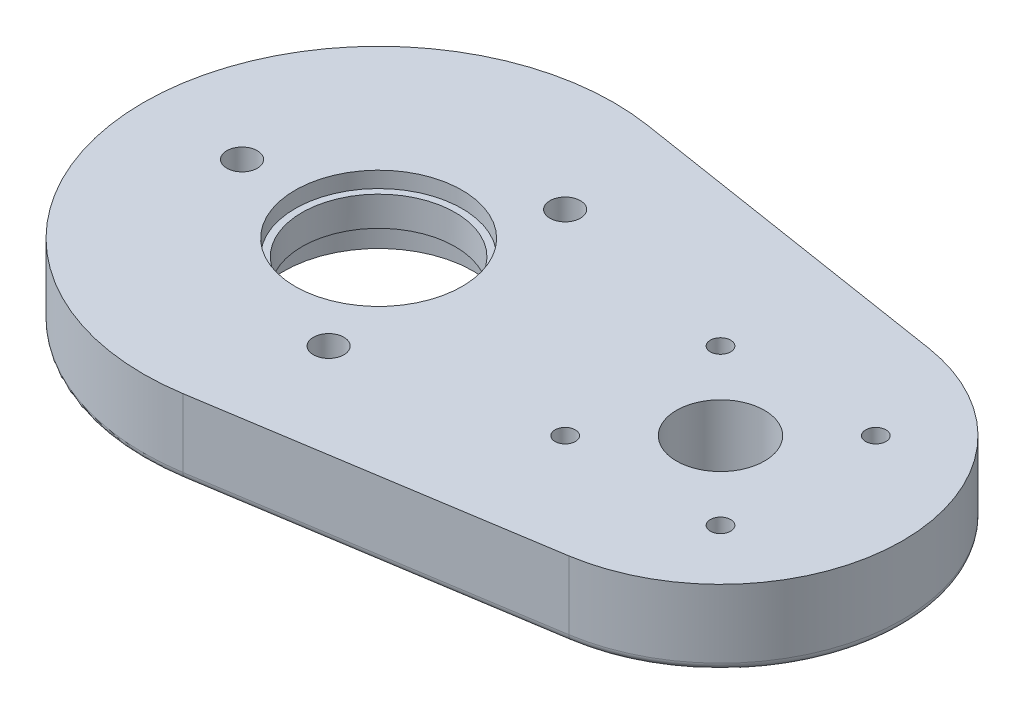
ISO-10303-21;
HEADER;
FILE_DESCRIPTION(('STEP AP214'),'2;1');
FILE_NAME('part.step','',(''),(''),'','','');
FILE_SCHEMA(('AUTOMOTIVE_DESIGN { 1 0 10303 214 1 1 1 1 }'));
ENDSEC;
DATA;
#1=APPLICATION_CONTEXT('core data for automotive mechanical design processes');
#2=APPLICATION_PROTOCOL_DEFINITION('international standard','automotive_design',2000,#1);
#3=PRODUCT_CONTEXT('',#1,'mechanical');
#4=PRODUCT('Part','Part','',(#3));
#5=PRODUCT_RELATED_PRODUCT_CATEGORY('part','',(#4));
#6=PRODUCT_DEFINITION_FORMATION('','',#4);
#7=PRODUCT_DEFINITION_CONTEXT('part definition',#1,'design');
#8=PRODUCT_DEFINITION('design','',#6,#7);
#9=PRODUCT_DEFINITION_SHAPE('','',#8);
#10=(LENGTH_UNIT() NAMED_UNIT(*) SI_UNIT(.MILLI.,.METRE.));
#11=(NAMED_UNIT(*) PLANE_ANGLE_UNIT() SI_UNIT($,.RADIAN.));
#12=(NAMED_UNIT(*) SI_UNIT($,.STERADIAN.) SOLID_ANGLE_UNIT());
#13=UNCERTAINTY_MEASURE_WITH_UNIT(LENGTH_MEASURE(1.E-05),#10,'distance_accuracy_value','');
#14=(GEOMETRIC_REPRESENTATION_CONTEXT(3) GLOBAL_UNCERTAINTY_ASSIGNED_CONTEXT((#13)) GLOBAL_UNIT_ASSIGNED_CONTEXT((#10,
#11,#12)) REPRESENTATION_CONTEXT('',''));
#15=CARTESIAN_POINT('',(0.,0.,0.));
#16=DIRECTION('',(0.,0.,1.));
#17=DIRECTION('',(1.,0.,0.));
#18=AXIS2_PLACEMENT_3D('',#15,#16,#17);
#19=CARTESIAN_POINT('',(-57.2262,0.,0.));
#20=DIRECTION('',(0.,1.,0.));
#21=DIRECTION('',(0.,0.,1.));
#22=AXIS2_PLACEMENT_3D('',#19,#20,#21);
#23=CYLINDRICAL_SURFACE('',#22,12.827);
#24=CARTESIAN_POINT('',(-57.2262,5.08,0.));
#25=DIRECTION('',(0.,-1.,0.));
#26=DIRECTION('',(0.,0.,-1.));
#27=AXIS2_PLACEMENT_3D('',#24,#25,#26);
#28=CIRCLE('',#27,12.827);
#29=CARTESIAN_POINT('',(-57.2262,5.08,-12.827));
#30=VERTEX_POINT('',#29);
#31=EDGE_CURVE('E805',#30,#30,#28,.T.);
#32=ORIENTED_EDGE('',*,*,#31,.T.);
#33=EDGE_LOOP('',(#32));
#34=FACE_BOUND('',#33,.T.);
#35=CARTESIAN_POINT('',(-57.2262,10.033,0.));
#36=DIRECTION('',(0.,1.,0.));
#37=DIRECTION('',(0.,0.,1.));
#38=AXIS2_PLACEMENT_3D('',#35,#36,#37);
#39=CIRCLE('',#38,12.827);
#40=CARTESIAN_POINT('',(-57.2262,10.033,12.827));
#41=VERTEX_POINT('',#40);
#42=EDGE_CURVE('E801',#41,#41,#39,.T.);
#43=ORIENTED_EDGE('',*,*,#42,.T.);
#44=EDGE_LOOP('',(#43));
#45=FACE_BOUND('',#44,.T.);
#46=ADVANCED_FACE('F34',(#34,#45),#23,.F.);
#47=CARTESIAN_POINT('',(-57.2262,12.7,0.));
#48=DIRECTION('',(0.,-1.,0.));
#49=DIRECTION('',(0.,0.,-1.));
#50=AXIS2_PLACEMENT_3D('',#47,#48,#49);
#51=CYLINDRICAL_SURFACE('',#50,39.37);
#52=DIRECTION('',(0.,-1.,0.));
#53=VECTOR('',#52,1.);
#54=CARTESIAN_POINT('',(-51.1101325343986,12.7,-38.8920379866652));
#55=LINE('',#54,#53);
#56=CARTESIAN_POINT('',(-51.1101325343986,12.7,-38.8920379866652));
#57=VERTEX_POINT('',#56);
#58=CARTESIAN_POINT('',(-51.1101325343986,1.27,-38.8920379866652));
#59=VERTEX_POINT('',#58);
#60=EDGE_CURVE('E263',#57,#59,#55,.T.);
#61=ORIENTED_EDGE('',*,*,#60,.T.);
#62=CARTESIAN_POINT('',(-57.2262,1.27,0.));
#63=DIRECTION('',(0.,1.,0.));
#64=DIRECTION('',(0.,0.,1.));
#65=AXIS2_PLACEMENT_3D('',#62,#63,#64);
#66=CIRCLE('',#65,39.37);
#67=CARTESIAN_POINT('',(-51.1101325343986,1.27,38.8920379866652));
#68=VERTEX_POINT('',#67);
#69=EDGE_CURVE('E110',#59,#68,#66,.T.);
#70=ORIENTED_EDGE('',*,*,#69,.T.);
#71=DIRECTION('',(0.,-1.,0.));
#72=VECTOR('',#71,1.);
#73=CARTESIAN_POINT('',(-51.1101325343986,12.7,38.8920379866652));
#74=LINE('',#73,#72);
#75=CARTESIAN_POINT('',(-51.1101325343986,12.7,38.8920379866652));
#76=VERTEX_POINT('',#75);
#77=EDGE_CURVE('E91',#76,#68,#74,.T.);
#78=ORIENTED_EDGE('',*,*,#77,.F.);
#79=CARTESIAN_POINT('',(-57.2262,12.7,0.));
#80=DIRECTION('',(0.,1.,0.));
#81=DIRECTION('',(0.,0.,1.));
#82=AXIS2_PLACEMENT_3D('',#79,#80,#81);
#83=CIRCLE('',#82,39.37);
#84=EDGE_CURVE('E96',#57,#76,#83,.T.);
#85=ORIENTED_EDGE('',*,*,#84,.F.);
#86=EDGE_LOOP('',(#61,#70,#78,#85));
#87=FACE_BOUND('',#86,.T.);
#88=ADVANCED_FACE('F108',(#87),#51,.T.);
#89=CARTESIAN_POINT('',(-51.1101325343986,12.7,38.8920379866652));
#90=DIRECTION('',(-0.155348424323125,0.,-0.987859740580778));
#91=DIRECTION('',(-0.987859740580778,0.,0.155348424323125));
#92=AXIS2_PLACEMENT_3D('',#89,#90,#91);
#93=PLANE('',#92);
#94=ORIENTED_EDGE('',*,*,#77,.T.);
#95=DIRECTION('',(0.987859740580778,0.,-0.155348424323125));
#96=VECTOR('',#95,1.);
#97=CARTESIAN_POINT('',(-51.1101325343986,1.27,38.8920379866652));
#98=LINE('',#97,#96);
#99=CARTESIAN_POINT('',(4.73501997336884,1.27,30.1099648929021));
#100=VERTEX_POINT('',#99);
#101=EDGE_CURVE('E11',#68,#100,#98,.T.);
#102=ORIENTED_EDGE('',*,*,#101,.T.);
#103=DIRECTION('',(0.,-1.,0.));
#104=VECTOR('',#103,1.);
#105=CARTESIAN_POINT('',(4.73501997336884,12.7,30.1099648929021));
#106=LINE('',#105,#104);
#107=CARTESIAN_POINT('',(4.73501997336884,12.7,30.1099648929021));
#108=VERTEX_POINT('',#107);
#109=EDGE_CURVE('E92',#108,#100,#106,.T.);
#110=ORIENTED_EDGE('',*,*,#109,.F.);
#111=DIRECTION('',(0.987859740580778,0.,-0.155348424323125));
#112=VECTOR('',#111,1.);
#113=CARTESIAN_POINT('',(-51.1101325343986,12.7,38.8920379866652));
#114=LINE('',#113,#112);
#115=EDGE_CURVE('E87',#76,#108,#114,.T.);
#116=ORIENTED_EDGE('',*,*,#115,.F.);
#117=EDGE_LOOP('',(#94,#102,#110,#116));
#118=FACE_BOUND('',#117,.T.);
#119=ADVANCED_FACE('F89',(#118),#93,.F.);
#120=CARTESIAN_POINT('',(0.,12.7,0.));
#121=DIRECTION('',(0.,-1.,0.));
#122=DIRECTION('',(0.,0.,-1.));
#123=AXIS2_PLACEMENT_3D('',#120,#121,#122);
#124=CYLINDRICAL_SURFACE('',#123,30.48);
#125=ORIENTED_EDGE('',*,*,#109,.T.);
#126=CARTESIAN_POINT('',(0.,1.27,0.));
#127=DIRECTION('',(0.,1.,0.));
#128=DIRECTION('',(0.,0.,1.));
#129=AXIS2_PLACEMENT_3D('',#126,#127,#128);
#130=CIRCLE('',#129,30.48);
#131=CARTESIAN_POINT('',(4.73501997336885,1.27,-30.1099648929021));
#132=VERTEX_POINT('',#131);
#133=EDGE_CURVE('E56',#100,#132,#130,.T.);
#134=ORIENTED_EDGE('',*,*,#133,.T.);
#135=DIRECTION('',(0.,-1.,0.));
#136=VECTOR('',#135,1.);
#137=CARTESIAN_POINT('',(4.73501997336885,12.7,-30.1099648929021));
#138=LINE('',#137,#136);
#139=CARTESIAN_POINT('',(4.73501997336885,12.7,-30.1099648929021));
#140=VERTEX_POINT('',#139);
#141=EDGE_CURVE('E114',#140,#132,#138,.T.);
#142=ORIENTED_EDGE('',*,*,#141,.F.);
#143=CARTESIAN_POINT('',(0.,12.7,0.));
#144=DIRECTION('',(0.,1.,0.));
#145=DIRECTION('',(0.,0.,1.));
#146=AXIS2_PLACEMENT_3D('',#143,#144,#145);
#147=CIRCLE('',#146,30.48);
#148=EDGE_CURVE('E95',#108,#140,#147,.T.);
#149=ORIENTED_EDGE('',*,*,#148,.F.);
#150=EDGE_LOOP('',(#125,#134,#142,#149));
#151=FACE_BOUND('',#150,.T.);
#152=ADVANCED_FACE('F306',(#151),#124,.T.);
#153=CARTESIAN_POINT('',(-51.1101325343986,12.7,-38.8920379866652));
#154=DIRECTION('',(-0.155348424323125,0.,0.987859740580778));
#155=DIRECTION('',(0.987859740580778,0.,0.155348424323125));
#156=AXIS2_PLACEMENT_3D('',#153,#154,#155);
#157=PLANE('',#156);
#158=ORIENTED_EDGE('',*,*,#141,.T.);
#159=DIRECTION('',(-0.987859740580778,0.,-0.155348424323125));
#160=VECTOR('',#159,1.);
#161=CARTESIAN_POINT('',(-51.1101325343986,1.27,-38.8920379866652));
#162=LINE('',#161,#160);
#163=EDGE_CURVE('E129',#132,#59,#162,.T.);
#164=ORIENTED_EDGE('',*,*,#163,.T.);
#165=ORIENTED_EDGE('',*,*,#60,.F.);
#166=DIRECTION('',(-0.987859740580778,0.,-0.155348424323125));
#167=VECTOR('',#166,1.);
#168=CARTESIAN_POINT('',(-51.1101325343986,12.7,-38.8920379866652));
#169=LINE('',#168,#167);
#170=EDGE_CURVE('E101',#140,#57,#169,.T.);
#171=ORIENTED_EDGE('',*,*,#170,.F.);
#172=EDGE_LOOP('',(#158,#164,#165,#171));
#173=FACE_BOUND('',#172,.T.);
#174=ADVANCED_FACE('F265',(#173),#157,.F.);
#175=CARTESIAN_POINT('',(-57.2262,12.7,0.));
#176=DIRECTION('',(0.,1.,0.));
#177=DIRECTION('',(0.,0.,1.));
#178=AXIS2_PLACEMENT_3D('',#175,#176,#177);
#179=PLANE('',#178);
#180=CARTESIAN_POINT('',(-57.2262,12.7,0.));
#181=DIRECTION('',(0.,1.,0.));
#182=DIRECTION('',(0.,0.,1.));
#183=AXIS2_PLACEMENT_3D('',#180,#181,#182);
#184=CIRCLE('',#183,13.97);
#185=CARTESIAN_POINT('',(-57.2262,12.7,13.97));
#186=VERTEX_POINT('',#185);
#187=EDGE_CURVE('E806',#186,#186,#184,.T.);
#188=ORIENTED_EDGE('',*,*,#187,.F.);
#189=EDGE_LOOP('',(#188));
#190=FACE_BOUND('',#189,.T.);
#191=CARTESIAN_POINT('',(-13.,12.7,-13.));
#192=DIRECTION('',(0.,-1.,0.));
#193=DIRECTION('',(0.,0.,-1.));
#194=AXIS2_PLACEMENT_3D('',#191,#192,#193);
#195=CIRCLE('',#194,1.7);
#196=CARTESIAN_POINT('',(-13.,12.7,-14.7));
#197=VERTEX_POINT('',#196);
#198=EDGE_CURVE('E166',#197,#197,#195,.T.);
#199=ORIENTED_EDGE('',*,*,#198,.T.);
#200=EDGE_LOOP('',(#199));
#201=FACE_BOUND('',#200,.T.);
#202=CARTESIAN_POINT('',(13.,12.7,13.));
#203=DIRECTION('',(0.,-1.,0.));
#204=DIRECTION('',(0.,0.,-1.));
#205=AXIS2_PLACEMENT_3D('',#202,#203,#204);
#206=CIRCLE('',#205,1.7);
#207=CARTESIAN_POINT('',(13.,12.7,11.3));
#208=VERTEX_POINT('',#207);
#209=EDGE_CURVE('E181',#208,#208,#206,.T.);
#210=ORIENTED_EDGE('',*,*,#209,.T.);
#211=EDGE_LOOP('',(#210));
#212=FACE_BOUND('',#211,.T.);
#213=CARTESIAN_POINT('',(13.,12.7,-13.));
#214=DIRECTION('',(0.,-1.,0.));
#215=DIRECTION('',(0.,0.,-1.));
#216=AXIS2_PLACEMENT_3D('',#213,#214,#215);
#217=CIRCLE('',#216,1.7);
#218=CARTESIAN_POINT('',(13.,12.7,-14.7));
#219=VERTEX_POINT('',#218);
#220=EDGE_CURVE('E196',#219,#219,#217,.T.);
#221=ORIENTED_EDGE('',*,*,#220,.T.);
#222=EDGE_LOOP('',(#221));
#223=FACE_BOUND('',#222,.T.);
#224=CARTESIAN_POINT('',(-13.,12.7,13.));
#225=DIRECTION('',(0.,-1.,0.));
#226=DIRECTION('',(0.,0.,-1.));
#227=AXIS2_PLACEMENT_3D('',#224,#225,#226);
#228=CIRCLE('',#227,1.7);
#229=CARTESIAN_POINT('',(-13.,12.7,11.3));
#230=VERTEX_POINT('',#229);
#231=EDGE_CURVE('E211',#230,#230,#228,.T.);
#232=ORIENTED_EDGE('',*,*,#231,.T.);
#233=EDGE_LOOP('',(#232));
#234=FACE_BOUND('',#233,.T.);
#235=CARTESIAN_POINT('',(-45.7962,12.7,-19.7973407305122));
#236=DIRECTION('',(0.,-1.,0.));
#237=DIRECTION('',(0.,0.,-1.));
#238=AXIS2_PLACEMENT_3D('',#235,#236,#237);
#239=CIRCLE('',#238,2.55270000000001);
#240=CARTESIAN_POINT('',(-45.7962,12.7,-22.3500407305122));
#241=VERTEX_POINT('',#240);
#242=EDGE_CURVE('E226',#241,#241,#239,.T.);
#243=ORIENTED_EDGE('',*,*,#242,.T.);
#244=EDGE_LOOP('',(#243));
#245=FACE_BOUND('',#244,.T.);
#246=CARTESIAN_POINT('',(-45.7962,12.7,19.7973407305122));
#247=DIRECTION('',(0.,-1.,0.));
#248=DIRECTION('',(0.,0.,-1.));
#249=AXIS2_PLACEMENT_3D('',#246,#247,#248);
#250=CIRCLE('',#249,2.55270000000001);
#251=CARTESIAN_POINT('',(-45.7962,12.7,17.2446407305122));
#252=VERTEX_POINT('',#251);
#253=EDGE_CURVE('E241',#252,#252,#250,.T.);
#254=ORIENTED_EDGE('',*,*,#253,.T.);
#255=EDGE_LOOP('',(#254));
#256=FACE_BOUND('',#255,.T.);
#257=CARTESIAN_POINT('',(-80.0862,12.7,0.));
#258=DIRECTION('',(0.,-1.,0.));
#259=DIRECTION('',(0.,0.,-1.));
#260=AXIS2_PLACEMENT_3D('',#257,#258,#259);
#261=CIRCLE('',#260,2.55270000000001);
#262=CARTESIAN_POINT('',(-80.0862,12.7,-2.55269999999996));
#263=VERTEX_POINT('',#262);
#264=EDGE_CURVE('E256',#263,#263,#261,.T.);
#265=ORIENTED_EDGE('',*,*,#264,.T.);
#266=EDGE_LOOP('',(#265));
#267=FACE_BOUND('',#266,.T.);
#268=CARTESIAN_POINT('',(0.,12.7,0.));
#269=DIRECTION('',(0.,1.,0.));
#270=DIRECTION('',(0.,0.,1.));
#271=AXIS2_PLACEMENT_3D('',#268,#269,#270);
#272=CIRCLE('',#271,7.366);
#273=CARTESIAN_POINT('',(0.,12.7,7.366));
#274=VERTEX_POINT('',#273);
#275=EDGE_CURVE('E105',#274,#274,#272,.T.);
#276=ORIENTED_EDGE('',*,*,#275,.F.);
#277=EDGE_LOOP('',(#276));
#278=FACE_BOUND('',#277,.T.);
#279=ORIENTED_EDGE('',*,*,#84,.T.);
#280=ORIENTED_EDGE('',*,*,#115,.T.);
#281=ORIENTED_EDGE('',*,*,#148,.T.);
#282=ORIENTED_EDGE('',*,*,#170,.T.);
#283=EDGE_LOOP('',(#279,#280,#281,#282));
#284=FACE_BOUND('',#283,.T.);
#285=ADVANCED_FACE('F99',(#190,#201,#212,#223,#234,#245,#256,#267,#278,#284),#179,.T.);
#286=CARTESIAN_POINT('',(-57.2262,0.,0.));
#287=DIRECTION('',(0.,1.,0.));
#288=DIRECTION('',(0.,0.,1.));
#289=AXIS2_PLACEMENT_3D('',#286,#287,#288);
#290=PLANE('',#289);
#291=CARTESIAN_POINT('',(-57.2262,0.,0.));
#292=DIRECTION('',(0.,-1.,0.));
#293=DIRECTION('',(0.,0.,-1.));
#294=AXIS2_PLACEMENT_3D('',#291,#292,#293);
#295=CIRCLE('',#294,15.875);
#296=CARTESIAN_POINT('',(-57.2262,0.,-15.875));
#297=VERTEX_POINT('',#296);
#298=EDGE_CURVE('E158',#297,#297,#295,.T.);
#299=ORIENTED_EDGE('',*,*,#298,.F.);
#300=EDGE_LOOP('',(#299));
#301=FACE_BOUND('',#300,.T.);
#302=CARTESIAN_POINT('',(0.,0.,0.));
#303=DIRECTION('',(0.,1.,0.));
#304=DIRECTION('',(0.,0.,1.));
#305=AXIS2_PLACEMENT_3D('',#302,#303,#304);
#306=CIRCLE('',#305,8.636);
#307=CARTESIAN_POINT('',(0.,0.,8.636));
#308=VERTEX_POINT('',#307);
#309=EDGE_CURVE('E126',#308,#308,#306,.T.);
#310=ORIENTED_EDGE('',*,*,#309,.T.);
#311=EDGE_LOOP('',(#310));
#312=FACE_BOUND('',#311,.T.);
#313=DIRECTION('',(0.987859740580778,0.,-0.155348424323125));
#314=VECTOR('',#313,1.);
#315=CARTESIAN_POINT('',(-51.3074250332889,0.,37.6374561161277));
#316=LINE('',#315,#314);
#317=CARTESIAN_POINT('',(4.53772747447847,0.,28.8553830223645));
#318=VERTEX_POINT('',#317);
#319=CARTESIAN_POINT('',(-51.3074250332889,0.,37.6374561161276));
#320=VERTEX_POINT('',#319);
#321=EDGE_CURVE('E112',#318,#320,#316,.F.);
#322=ORIENTED_EDGE('',*,*,#321,.T.);
#323=CARTESIAN_POINT('',(-57.2262,0.,0.));
#324=DIRECTION('',(0.,1.,0.));
#325=DIRECTION('',(0.,0.,1.));
#326=AXIS2_PLACEMENT_3D('',#323,#324,#325);
#327=CIRCLE('',#326,38.1);
#328=CARTESIAN_POINT('',(-51.3074250332889,0.,-37.6374561161277));
#329=VERTEX_POINT('',#328);
#330=EDGE_CURVE('E123',#320,#329,#327,.F.);
#331=ORIENTED_EDGE('',*,*,#330,.T.);
#332=DIRECTION('',(-0.987859740580778,0.,-0.155348424323125));
#333=VECTOR('',#332,1.);
#334=CARTESIAN_POINT('',(-51.3074250332889,0.,-37.6374561161277));
#335=LINE('',#334,#333);
#336=CARTESIAN_POINT('',(4.53772747447848,0.,-28.8553830223645));
#337=VERTEX_POINT('',#336);
#338=EDGE_CURVE('E121',#329,#337,#335,.F.);
#339=ORIENTED_EDGE('',*,*,#338,.T.);
#340=CARTESIAN_POINT('',(0.,0.,0.));
#341=DIRECTION('',(0.,1.,0.));
#342=DIRECTION('',(0.,0.,1.));
#343=AXIS2_PLACEMENT_3D('',#340,#341,#342);
#344=CIRCLE('',#343,29.21);
#345=EDGE_CURVE('E119',#337,#318,#344,.F.);
#346=ORIENTED_EDGE('',*,*,#345,.T.);
#347=EDGE_LOOP('',(#322,#331,#339,#346));
#348=FACE_BOUND('',#347,.T.);
#349=CARTESIAN_POINT('',(-13.,0.,-13.));
#350=DIRECTION('',(0.,-1.,0.));
#351=DIRECTION('',(0.,0.,-1.));
#352=AXIS2_PLACEMENT_3D('',#349,#350,#351);
#353=CIRCLE('',#352,4.);
#354=CARTESIAN_POINT('',(-13.,0.,-17.));
#355=VERTEX_POINT('',#354);
#356=EDGE_CURVE('E144',#355,#355,#353,.T.);
#357=ORIENTED_EDGE('',*,*,#356,.F.);
#358=EDGE_LOOP('',(#357));
#359=FACE_BOUND('',#358,.T.);
#360=CARTESIAN_POINT('',(13.,0.,13.));
#361=DIRECTION('',(0.,-1.,0.));
#362=DIRECTION('',(0.,0.,-1.));
#363=AXIS2_PLACEMENT_3D('',#360,#361,#362);
#364=CIRCLE('',#363,4.);
#365=CARTESIAN_POINT('',(13.,0.,9.));
#366=VERTEX_POINT('',#365);
#367=EDGE_CURVE('E169',#366,#366,#364,.T.);
#368=ORIENTED_EDGE('',*,*,#367,.F.);
#369=EDGE_LOOP('',(#368));
#370=FACE_BOUND('',#369,.T.);
#371=CARTESIAN_POINT('',(13.,0.,-13.));
#372=DIRECTION('',(0.,-1.,0.));
#373=DIRECTION('',(0.,0.,-1.));
#374=AXIS2_PLACEMENT_3D('',#371,#372,#373);
#375=CIRCLE('',#374,4.);
#376=CARTESIAN_POINT('',(13.,0.,-17.));
#377=VERTEX_POINT('',#376);
#378=EDGE_CURVE('E184',#377,#377,#375,.T.);
#379=ORIENTED_EDGE('',*,*,#378,.F.);
#380=EDGE_LOOP('',(#379));
#381=FACE_BOUND('',#380,.T.);
#382=CARTESIAN_POINT('',(-13.,0.,13.));
#383=DIRECTION('',(0.,-1.,0.));
#384=DIRECTION('',(0.,0.,-1.));
#385=AXIS2_PLACEMENT_3D('',#382,#383,#384);
#386=CIRCLE('',#385,4.);
#387=CARTESIAN_POINT('',(-13.,0.,9.));
#388=VERTEX_POINT('',#387);
#389=EDGE_CURVE('E199',#388,#388,#386,.T.);
#390=ORIENTED_EDGE('',*,*,#389,.F.);
#391=EDGE_LOOP('',(#390));
#392=FACE_BOUND('',#391,.T.);
#393=CARTESIAN_POINT('',(-45.7962,0.,-19.7973407305122));
#394=DIRECTION('',(0.,-1.,0.));
#395=DIRECTION('',(0.,0.,-1.));
#396=AXIS2_PLACEMENT_3D('',#393,#394,#395);
#397=CIRCLE('',#396,5.3975);
#398=CARTESIAN_POINT('',(-45.7962,0.,-25.1948407305122));
#399=VERTEX_POINT('',#398);
#400=EDGE_CURVE('E214',#399,#399,#397,.T.);
#401=ORIENTED_EDGE('',*,*,#400,.F.);
#402=EDGE_LOOP('',(#401));
#403=FACE_BOUND('',#402,.T.);
#404=CARTESIAN_POINT('',(-45.7962,0.,19.7973407305122));
#405=DIRECTION('',(0.,-1.,0.));
#406=DIRECTION('',(0.,0.,-1.));
#407=AXIS2_PLACEMENT_3D('',#404,#405,#406);
#408=CIRCLE('',#407,5.3975);
#409=CARTESIAN_POINT('',(-45.7962,0.,14.3998407305122));
#410=VERTEX_POINT('',#409);
#411=EDGE_CURVE('E229',#410,#410,#408,.T.);
#412=ORIENTED_EDGE('',*,*,#411,.F.);
#413=EDGE_LOOP('',(#412));
#414=FACE_BOUND('',#413,.T.);
#415=CARTESIAN_POINT('',(-80.0862,0.,0.));
#416=DIRECTION('',(0.,-1.,0.));
#417=DIRECTION('',(0.,0.,-1.));
#418=AXIS2_PLACEMENT_3D('',#415,#416,#417);
#419=CIRCLE('',#418,5.3975);
#420=CARTESIAN_POINT('',(-80.0862,0.,-5.39749999999995));
#421=VERTEX_POINT('',#420);
#422=EDGE_CURVE('E244',#421,#421,#419,.T.);
#423=ORIENTED_EDGE('',*,*,#422,.F.);
#424=EDGE_LOOP('',(#423));
#425=FACE_BOUND('',#424,.T.);
#426=ADVANCED_FACE('F299',(#301,#312,#348,#359,#370,#381,#392,#403,#414,#425),#290,.F.);
#427=CARTESIAN_POINT('',(0.,0.,0.));
#428=DIRECTION('',(0.,1.,0.));
#429=DIRECTION('',(0.,0.,1.));
#430=AXIS2_PLACEMENT_3D('',#427,#428,#429);
#431=CYLINDRICAL_SURFACE('',#430,7.366);
#432=CARTESIAN_POINT('',(0.,1.27,0.));
#433=DIRECTION('',(0.,1.,0.));
#434=DIRECTION('',(0.,0.,1.));
#435=AXIS2_PLACEMENT_3D('',#432,#433,#434);
#436=CIRCLE('',#435,7.366);
#437=CARTESIAN_POINT('',(0.,1.27,7.366));
#438=VERTEX_POINT('',#437);
#439=EDGE_CURVE('E43',#438,#438,#436,.F.);
#440=ORIENTED_EDGE('',*,*,#439,.T.);
#441=EDGE_LOOP('',(#440));
#442=FACE_BOUND('',#441,.T.);
#443=ORIENTED_EDGE('',*,*,#275,.T.);
#444=EDGE_LOOP('',(#443));
#445=FACE_BOUND('',#444,.T.);
#446=ADVANCED_FACE('F295',(#442,#445),#431,.F.);
#447=CARTESIAN_POINT('',(-80.0862,0.,0.));
#448=DIRECTION('',(0.,-1.,0.));
#449=DIRECTION('',(0.,0.,-1.));
#450=AXIS2_PLACEMENT_3D('',#447,#448,#449);
#451=CYLINDRICAL_SURFACE('',#450,2.55270000000001);
#452=ORIENTED_EDGE('',*,*,#264,.F.);
#453=EDGE_LOOP('',(#452));
#454=FACE_BOUND('',#453,.T.);
#455=CARTESIAN_POINT('',(-80.0862,4.826,0.));
#456=DIRECTION('',(0.,-1.,0.));
#457=DIRECTION('',(0.,0.,-1.));
#458=AXIS2_PLACEMENT_3D('',#455,#456,#457);
#459=CIRCLE('',#458,2.55270000000001);
#460=CARTESIAN_POINT('',(-80.0862,4.826,-2.55269999999996));
#461=VERTEX_POINT('',#460);
#462=EDGE_CURVE('E253',#461,#461,#459,.T.);
#463=ORIENTED_EDGE('',*,*,#462,.T.);
#464=EDGE_LOOP('',(#463));
#465=FACE_BOUND('',#464,.T.);
#466=ADVANCED_FACE('F339',(#454,#465),#451,.F.);
#467=CARTESIAN_POINT('',(-75.3237,4.826,0.));
#468=DIRECTION('',(0.,1.,0.));
#469=DIRECTION('',(0.,0.,1.));
#470=AXIS2_PLACEMENT_3D('',#467,#468,#469);
#471=PLANE('',#470);
#472=ORIENTED_EDGE('',*,*,#462,.F.);
#473=EDGE_LOOP('',(#472));
#474=FACE_BOUND('',#473,.T.);
#475=CARTESIAN_POINT('',(-80.0862,4.826,0.));
#476=DIRECTION('',(0.,-1.,0.));
#477=DIRECTION('',(0.,0.,-1.));
#478=AXIS2_PLACEMENT_3D('',#475,#476,#477);
#479=CIRCLE('',#478,4.7625);
#480=CARTESIAN_POINT('',(-80.0862,4.826,-4.76249999999995));
#481=VERTEX_POINT('',#480);
#482=EDGE_CURVE('E250',#481,#481,#479,.T.);
#483=ORIENTED_EDGE('',*,*,#482,.T.);
#484=EDGE_LOOP('',(#483));
#485=FACE_BOUND('',#484,.T.);
#486=ADVANCED_FACE('F347',(#474,#485),#471,.F.);
#487=CARTESIAN_POINT('',(-80.0862,0.,0.));
#488=DIRECTION('',(0.,-1.,0.));
#489=DIRECTION('',(0.,0.,-1.));
#490=AXIS2_PLACEMENT_3D('',#487,#488,#489);
#491=CYLINDRICAL_SURFACE('',#490,4.7625);
#492=ORIENTED_EDGE('',*,*,#482,.F.);
#493=EDGE_LOOP('',(#492));
#494=FACE_BOUND('',#493,.T.);
#495=CARTESIAN_POINT('',(-80.0862,0.635000000000002,0.));
#496=DIRECTION('',(0.,-1.,0.));
#497=DIRECTION('',(0.,0.,-1.));
#498=AXIS2_PLACEMENT_3D('',#495,#496,#497);
#499=CIRCLE('',#498,4.7625);
#500=CARTESIAN_POINT('',(-80.0862,0.635000000000002,-4.76249999999995));
#501=VERTEX_POINT('',#500);
#502=EDGE_CURVE('E247',#501,#501,#499,.T.);
#503=ORIENTED_EDGE('',*,*,#502,.T.);
#504=EDGE_LOOP('',(#503));
#505=FACE_BOUND('',#504,.T.);
#506=ADVANCED_FACE('F354',(#494,#505),#491,.F.);
#507=CARTESIAN_POINT('',(-80.0862,0.,0.));
#508=DIRECTION('',(0.,-1.,0.));
#509=DIRECTION('',(0.,0.,-1.));
#510=AXIS2_PLACEMENT_3D('',#507,#508,#509);
#511=CONICAL_SURFACE('',#510,5.3975,0.785398163397445);
#512=ORIENTED_EDGE('',*,*,#502,.F.);
#513=EDGE_LOOP('',(#512));
#514=FACE_BOUND('',#513,.T.);
#515=ORIENTED_EDGE('',*,*,#422,.T.);
#516=EDGE_LOOP('',(#515));
#517=FACE_BOUND('',#516,.T.);
#518=ADVANCED_FACE('F362',(#514,#517),#511,.F.);
#519=CARTESIAN_POINT('',(-45.7962,0.,19.7973407305122));
#520=DIRECTION('',(0.,-1.,0.));
#521=DIRECTION('',(0.,0.,-1.));
#522=AXIS2_PLACEMENT_3D('',#519,#520,#521);
#523=CYLINDRICAL_SURFACE('',#522,2.5527);
#524=ORIENTED_EDGE('',*,*,#253,.F.);
#525=EDGE_LOOP('',(#524));
#526=FACE_BOUND('',#525,.T.);
#527=CARTESIAN_POINT('',(-45.7962,4.826,19.7973407305122));
#528=DIRECTION('',(0.,-1.,0.));
#529=DIRECTION('',(0.,0.,-1.));
#530=AXIS2_PLACEMENT_3D('',#527,#528,#529);
#531=CIRCLE('',#530,2.5527);
#532=CARTESIAN_POINT('',(-45.7962,4.826,17.2446407305122));
#533=VERTEX_POINT('',#532);
#534=EDGE_CURVE('E238',#533,#533,#531,.T.);
#535=ORIENTED_EDGE('',*,*,#534,.T.);
#536=EDGE_LOOP('',(#535));
#537=FACE_BOUND('',#536,.T.);
#538=ADVANCED_FACE('F370',(#526,#537),#523,.F.);
#539=CARTESIAN_POINT('',(-41.0337,4.826,19.7973407305122));
#540=DIRECTION('',(0.,1.,0.));
#541=DIRECTION('',(0.,0.,1.));
#542=AXIS2_PLACEMENT_3D('',#539,#540,#541);
#543=PLANE('',#542);
#544=ORIENTED_EDGE('',*,*,#534,.F.);
#545=EDGE_LOOP('',(#544));
#546=FACE_BOUND('',#545,.T.);
#547=CARTESIAN_POINT('',(-45.7962,4.826,19.7973407305122));
#548=DIRECTION('',(0.,-1.,0.));
#549=DIRECTION('',(0.,0.,-1.));
#550=AXIS2_PLACEMENT_3D('',#547,#548,#549);
#551=CIRCLE('',#550,4.7625);
#552=CARTESIAN_POINT('',(-45.7962,4.826,15.0348407305122));
#553=VERTEX_POINT('',#552);
#554=EDGE_CURVE('E235',#553,#553,#551,.T.);
#555=ORIENTED_EDGE('',*,*,#554,.T.);
#556=EDGE_LOOP('',(#555));
#557=FACE_BOUND('',#556,.T.);
#558=ADVANCED_FACE('F378',(#546,#557),#543,.F.);
#559=CARTESIAN_POINT('',(-45.7962,0.,19.7973407305122));
#560=DIRECTION('',(0.,-1.,0.));
#561=DIRECTION('',(0.,0.,-1.));
#562=AXIS2_PLACEMENT_3D('',#559,#560,#561);
#563=CYLINDRICAL_SURFACE('',#562,4.7625);
#564=ORIENTED_EDGE('',*,*,#554,.F.);
#565=EDGE_LOOP('',(#564));
#566=FACE_BOUND('',#565,.T.);
#567=CARTESIAN_POINT('',(-45.7962,0.635000000000002,19.7973407305122));
#568=DIRECTION('',(0.,-1.,0.));
#569=DIRECTION('',(0.,0.,-1.));
#570=AXIS2_PLACEMENT_3D('',#567,#568,#569);
#571=CIRCLE('',#570,4.7625);
#572=CARTESIAN_POINT('',(-45.7962,0.635000000000002,15.0348407305122));
#573=VERTEX_POINT('',#572);
#574=EDGE_CURVE('E232',#573,#573,#571,.T.);
#575=ORIENTED_EDGE('',*,*,#574,.T.);
#576=EDGE_LOOP('',(#575));
#577=FACE_BOUND('',#576,.T.);
#578=ADVANCED_FACE('F386',(#566,#577),#563,.F.);
#579=CARTESIAN_POINT('',(-45.7962,0.,19.7973407305122));
#580=DIRECTION('',(0.,-1.,0.));
#581=DIRECTION('',(0.,0.,-1.));
#582=AXIS2_PLACEMENT_3D('',#579,#580,#581);
#583=CONICAL_SURFACE('',#582,5.3975,0.78539816339745);
#584=ORIENTED_EDGE('',*,*,#574,.F.);
#585=EDGE_LOOP('',(#584));
#586=FACE_BOUND('',#585,.T.);
#587=ORIENTED_EDGE('',*,*,#411,.T.);
#588=EDGE_LOOP('',(#587));
#589=FACE_BOUND('',#588,.T.);
#590=ADVANCED_FACE('F394',(#586,#589),#583,.F.);
#591=CARTESIAN_POINT('',(-45.7962,0.,-19.7973407305122));
#592=DIRECTION('',(0.,-1.,0.));
#593=DIRECTION('',(0.,0.,-1.));
#594=AXIS2_PLACEMENT_3D('',#591,#592,#593);
#595=CYLINDRICAL_SURFACE('',#594,2.55270000000001);
#596=ORIENTED_EDGE('',*,*,#242,.F.);
#597=EDGE_LOOP('',(#596));
#598=FACE_BOUND('',#597,.T.);
#599=CARTESIAN_POINT('',(-45.7962,4.826,-19.7973407305122));
#600=DIRECTION('',(0.,-1.,0.));
#601=DIRECTION('',(0.,0.,-1.));
#602=AXIS2_PLACEMENT_3D('',#599,#600,#601);
#603=CIRCLE('',#602,2.5527);
#604=CARTESIAN_POINT('',(-45.7962,4.826,-22.3500407305122));
#605=VERTEX_POINT('',#604);
#606=EDGE_CURVE('E223',#605,#605,#603,.T.);
#607=ORIENTED_EDGE('',*,*,#606,.T.);
#608=EDGE_LOOP('',(#607));
#609=FACE_BOUND('',#608,.T.);
#610=ADVANCED_FACE('F402',(#598,#609),#595,.F.);
#611=CARTESIAN_POINT('',(-41.0337,4.826,-19.7973407305122));
#612=DIRECTION('',(0.,1.,0.));
#613=DIRECTION('',(0.,0.,1.));
#614=AXIS2_PLACEMENT_3D('',#611,#612,#613);
#615=PLANE('',#614);
#616=ORIENTED_EDGE('',*,*,#606,.F.);
#617=EDGE_LOOP('',(#616));
#618=FACE_BOUND('',#617,.T.);
#619=CARTESIAN_POINT('',(-45.7962,4.826,-19.7973407305122));
#620=DIRECTION('',(0.,-1.,0.));
#621=DIRECTION('',(0.,0.,-1.));
#622=AXIS2_PLACEMENT_3D('',#619,#620,#621);
#623=CIRCLE('',#622,4.7625);
#624=CARTESIAN_POINT('',(-45.7962,4.826,-24.5598407305122));
#625=VERTEX_POINT('',#624);
#626=EDGE_CURVE('E220',#625,#625,#623,.T.);
#627=ORIENTED_EDGE('',*,*,#626,.T.);
#628=EDGE_LOOP('',(#627));
#629=FACE_BOUND('',#628,.T.);
#630=ADVANCED_FACE('F410',(#618,#629),#615,.F.);
#631=CARTESIAN_POINT('',(-45.7962,0.,-19.7973407305122));
#632=DIRECTION('',(0.,-1.,0.));
#633=DIRECTION('',(0.,0.,-1.));
#634=AXIS2_PLACEMENT_3D('',#631,#632,#633);
#635=CYLINDRICAL_SURFACE('',#634,4.7625);
#636=ORIENTED_EDGE('',*,*,#626,.F.);
#637=EDGE_LOOP('',(#636));
#638=FACE_BOUND('',#637,.T.);
#639=CARTESIAN_POINT('',(-45.7962,0.635000000000002,-19.7973407305122));
#640=DIRECTION('',(0.,-1.,0.));
#641=DIRECTION('',(0.,0.,-1.));
#642=AXIS2_PLACEMENT_3D('',#639,#640,#641);
#643=CIRCLE('',#642,4.7625);
#644=CARTESIAN_POINT('',(-45.7962,0.635000000000002,-24.5598407305122));
#645=VERTEX_POINT('',#644);
#646=EDGE_CURVE('E217',#645,#645,#643,.T.);
#647=ORIENTED_EDGE('',*,*,#646,.T.);
#648=EDGE_LOOP('',(#647));
#649=FACE_BOUND('',#648,.T.);
#650=ADVANCED_FACE('F418',(#638,#649),#635,.F.);
#651=CARTESIAN_POINT('',(-45.7962,0.,-19.7973407305122));
#652=DIRECTION('',(0.,-1.,0.));
#653=DIRECTION('',(0.,0.,-1.));
#654=AXIS2_PLACEMENT_3D('',#651,#652,#653);
#655=CONICAL_SURFACE('',#654,5.3975,0.78539816339745);
#656=ORIENTED_EDGE('',*,*,#646,.F.);
#657=EDGE_LOOP('',(#656));
#658=FACE_BOUND('',#657,.T.);
#659=ORIENTED_EDGE('',*,*,#400,.T.);
#660=EDGE_LOOP('',(#659));
#661=FACE_BOUND('',#660,.T.);
#662=ADVANCED_FACE('F426',(#658,#661),#655,.F.);
#663=CARTESIAN_POINT('',(-13.,0.,13.));
#664=DIRECTION('',(0.,-1.,0.));
#665=DIRECTION('',(0.,0.,-1.));
#666=AXIS2_PLACEMENT_3D('',#663,#664,#665);
#667=CYLINDRICAL_SURFACE('',#666,1.7);
#668=ORIENTED_EDGE('',*,*,#231,.F.);
#669=EDGE_LOOP('',(#668));
#670=FACE_BOUND('',#669,.T.);
#671=CARTESIAN_POINT('',(-13.,3.,13.));
#672=DIRECTION('',(0.,-1.,0.));
#673=DIRECTION('',(0.,0.,-1.));
#674=AXIS2_PLACEMENT_3D('',#671,#672,#673);
#675=CIRCLE('',#674,1.7);
#676=CARTESIAN_POINT('',(-13.,3.,11.3));
#677=VERTEX_POINT('',#676);
#678=EDGE_CURVE('E208',#677,#677,#675,.T.);
#679=ORIENTED_EDGE('',*,*,#678,.T.);
#680=EDGE_LOOP('',(#679));
#681=FACE_BOUND('',#680,.T.);
#682=ADVANCED_FACE('F434',(#670,#681),#667,.F.);
#683=CARTESIAN_POINT('',(-9.75,3.,13.));
#684=DIRECTION('',(0.,1.,0.));
#685=DIRECTION('',(0.,0.,1.));
#686=AXIS2_PLACEMENT_3D('',#683,#684,#685);
#687=PLANE('',#686);
#688=ORIENTED_EDGE('',*,*,#678,.F.);
#689=EDGE_LOOP('',(#688));
#690=FACE_BOUND('',#689,.T.);
#691=CARTESIAN_POINT('',(-13.,3.,13.));
#692=DIRECTION('',(0.,-1.,0.));
#693=DIRECTION('',(0.,0.,-1.));
#694=AXIS2_PLACEMENT_3D('',#691,#692,#693);
#695=CIRCLE('',#694,3.25);
#696=CARTESIAN_POINT('',(-13.,3.,9.75000000000001));
#697=VERTEX_POINT('',#696);
#698=EDGE_CURVE('E205',#697,#697,#695,.T.);
#699=ORIENTED_EDGE('',*,*,#698,.T.);
#700=EDGE_LOOP('',(#699));
#701=FACE_BOUND('',#700,.T.);
#702=ADVANCED_FACE('F442',(#690,#701),#687,.F.);
#703=CARTESIAN_POINT('',(-13.,0.,13.));
#704=DIRECTION('',(0.,-1.,0.));
#705=DIRECTION('',(0.,0.,-1.));
#706=AXIS2_PLACEMENT_3D('',#703,#704,#705);
#707=CYLINDRICAL_SURFACE('',#706,3.25);
#708=ORIENTED_EDGE('',*,*,#698,.F.);
#709=EDGE_LOOP('',(#708));
#710=FACE_BOUND('',#709,.T.);
#711=CARTESIAN_POINT('',(-13.,0.750000000000001,13.));
#712=DIRECTION('',(0.,-1.,0.));
#713=DIRECTION('',(0.,0.,-1.));
#714=AXIS2_PLACEMENT_3D('',#711,#712,#713);
#715=CIRCLE('',#714,3.25);
#716=CARTESIAN_POINT('',(-13.,0.750000000000001,9.75));
#717=VERTEX_POINT('',#716);
#718=EDGE_CURVE('E202',#717,#717,#715,.T.);
#719=ORIENTED_EDGE('',*,*,#718,.T.);
#720=EDGE_LOOP('',(#719));
#721=FACE_BOUND('',#720,.T.);
#722=ADVANCED_FACE('F450',(#710,#721),#707,.F.);
#723=CARTESIAN_POINT('',(-13.,0.,13.));
#724=DIRECTION('',(0.,-1.,0.));
#725=DIRECTION('',(0.,0.,-1.));
#726=AXIS2_PLACEMENT_3D('',#723,#724,#725);
#727=CONICAL_SURFACE('',#726,4.,0.785398163397446);
#728=ORIENTED_EDGE('',*,*,#718,.F.);
#729=EDGE_LOOP('',(#728));
#730=FACE_BOUND('',#729,.T.);
#731=ORIENTED_EDGE('',*,*,#389,.T.);
#732=EDGE_LOOP('',(#731));
#733=FACE_BOUND('',#732,.T.);
#734=ADVANCED_FACE('F458',(#730,#733),#727,.F.);
#735=CARTESIAN_POINT('',(13.,0.,-13.));
#736=DIRECTION('',(0.,-1.,0.));
#737=DIRECTION('',(0.,0.,-1.));
#738=AXIS2_PLACEMENT_3D('',#735,#736,#737);
#739=CYLINDRICAL_SURFACE('',#738,1.7);
#740=ORIENTED_EDGE('',*,*,#220,.F.);
#741=EDGE_LOOP('',(#740));
#742=FACE_BOUND('',#741,.T.);
#743=CARTESIAN_POINT('',(13.,3.,-13.));
#744=DIRECTION('',(0.,-1.,0.));
#745=DIRECTION('',(0.,0.,-1.));
#746=AXIS2_PLACEMENT_3D('',#743,#744,#745);
#747=CIRCLE('',#746,1.7);
#748=CARTESIAN_POINT('',(13.,3.,-14.7));
#749=VERTEX_POINT('',#748);
#750=EDGE_CURVE('E193',#749,#749,#747,.T.);
#751=ORIENTED_EDGE('',*,*,#750,.T.);
#752=EDGE_LOOP('',(#751));
#753=FACE_BOUND('',#752,.T.);
#754=ADVANCED_FACE('F466',(#742,#753),#739,.F.);
#755=CARTESIAN_POINT('',(16.25,3.,-13.));
#756=DIRECTION('',(0.,1.,0.));
#757=DIRECTION('',(0.,0.,1.));
#758=AXIS2_PLACEMENT_3D('',#755,#756,#757);
#759=PLANE('',#758);
#760=ORIENTED_EDGE('',*,*,#750,.F.);
#761=EDGE_LOOP('',(#760));
#762=FACE_BOUND('',#761,.T.);
#763=CARTESIAN_POINT('',(13.,3.,-13.));
#764=DIRECTION('',(0.,-1.,0.));
#765=DIRECTION('',(0.,0.,-1.));
#766=AXIS2_PLACEMENT_3D('',#763,#764,#765);
#767=CIRCLE('',#766,3.25);
#768=CARTESIAN_POINT('',(13.,3.,-16.25));
#769=VERTEX_POINT('',#768);
#770=EDGE_CURVE('E190',#769,#769,#767,.T.);
#771=ORIENTED_EDGE('',*,*,#770,.T.);
#772=EDGE_LOOP('',(#771));
#773=FACE_BOUND('',#772,.T.);
#774=ADVANCED_FACE('F474',(#762,#773),#759,.F.);
#775=CARTESIAN_POINT('',(13.,0.,-13.));
#776=DIRECTION('',(0.,-1.,0.));
#777=DIRECTION('',(0.,0.,-1.));
#778=AXIS2_PLACEMENT_3D('',#775,#776,#777);
#779=CYLINDRICAL_SURFACE('',#778,3.25);
#780=ORIENTED_EDGE('',*,*,#770,.F.);
#781=EDGE_LOOP('',(#780));
#782=FACE_BOUND('',#781,.T.);
#783=CARTESIAN_POINT('',(13.,0.750000000000001,-13.));
#784=DIRECTION('',(0.,-1.,0.));
#785=DIRECTION('',(0.,0.,-1.));
#786=AXIS2_PLACEMENT_3D('',#783,#784,#785);
#787=CIRCLE('',#786,3.25);
#788=CARTESIAN_POINT('',(13.,0.750000000000001,-16.25));
#789=VERTEX_POINT('',#788);
#790=EDGE_CURVE('E187',#789,#789,#787,.T.);
#791=ORIENTED_EDGE('',*,*,#790,.T.);
#792=EDGE_LOOP('',(#791));
#793=FACE_BOUND('',#792,.T.);
#794=ADVANCED_FACE('F482',(#782,#793),#779,.F.);
#795=CARTESIAN_POINT('',(13.,0.,-13.));
#796=DIRECTION('',(0.,-1.,0.));
#797=DIRECTION('',(0.,0.,-1.));
#798=AXIS2_PLACEMENT_3D('',#795,#796,#797);
#799=CONICAL_SURFACE('',#798,4.,0.785398163397446);
#800=ORIENTED_EDGE('',*,*,#790,.F.);
#801=EDGE_LOOP('',(#800));
#802=FACE_BOUND('',#801,.T.);
#803=ORIENTED_EDGE('',*,*,#378,.T.);
#804=EDGE_LOOP('',(#803));
#805=FACE_BOUND('',#804,.T.);
#806=ADVANCED_FACE('F490',(#802,#805),#799,.F.);
#807=CARTESIAN_POINT('',(13.,0.,13.));
#808=DIRECTION('',(0.,-1.,0.));
#809=DIRECTION('',(0.,0.,-1.));
#810=AXIS2_PLACEMENT_3D('',#807,#808,#809);
#811=CYLINDRICAL_SURFACE('',#810,1.7);
#812=ORIENTED_EDGE('',*,*,#209,.F.);
#813=EDGE_LOOP('',(#812));
#814=FACE_BOUND('',#813,.T.);
#815=CARTESIAN_POINT('',(13.,3.,13.));
#816=DIRECTION('',(0.,-1.,0.));
#817=DIRECTION('',(0.,0.,-1.));
#818=AXIS2_PLACEMENT_3D('',#815,#816,#817);
#819=CIRCLE('',#818,1.7);
#820=CARTESIAN_POINT('',(13.,3.,11.3));
#821=VERTEX_POINT('',#820);
#822=EDGE_CURVE('E178',#821,#821,#819,.T.);
#823=ORIENTED_EDGE('',*,*,#822,.T.);
#824=EDGE_LOOP('',(#823));
#825=FACE_BOUND('',#824,.T.);
#826=ADVANCED_FACE('F498',(#814,#825),#811,.F.);
#827=CARTESIAN_POINT('',(16.25,3.,13.));
#828=DIRECTION('',(0.,1.,0.));
#829=DIRECTION('',(0.,0.,1.));
#830=AXIS2_PLACEMENT_3D('',#827,#828,#829);
#831=PLANE('',#830);
#832=ORIENTED_EDGE('',*,*,#822,.F.);
#833=EDGE_LOOP('',(#832));
#834=FACE_BOUND('',#833,.T.);
#835=CARTESIAN_POINT('',(13.,3.,13.));
#836=DIRECTION('',(0.,-1.,0.));
#837=DIRECTION('',(0.,0.,-1.));
#838=AXIS2_PLACEMENT_3D('',#835,#836,#837);
#839=CIRCLE('',#838,3.25);
#840=CARTESIAN_POINT('',(13.,3.,9.75000000000001));
#841=VERTEX_POINT('',#840);
#842=EDGE_CURVE('E175',#841,#841,#839,.T.);
#843=ORIENTED_EDGE('',*,*,#842,.T.);
#844=EDGE_LOOP('',(#843));
#845=FACE_BOUND('',#844,.T.);
#846=ADVANCED_FACE('F506',(#834,#845),#831,.F.);
#847=CARTESIAN_POINT('',(13.,0.,13.));
#848=DIRECTION('',(0.,-1.,0.));
#849=DIRECTION('',(0.,0.,-1.));
#850=AXIS2_PLACEMENT_3D('',#847,#848,#849);
#851=CYLINDRICAL_SURFACE('',#850,3.25);
#852=ORIENTED_EDGE('',*,*,#842,.F.);
#853=EDGE_LOOP('',(#852));
#854=FACE_BOUND('',#853,.T.);
#855=CARTESIAN_POINT('',(13.,0.750000000000001,13.));
#856=DIRECTION('',(0.,-1.,0.));
#857=DIRECTION('',(0.,0.,-1.));
#858=AXIS2_PLACEMENT_3D('',#855,#856,#857);
#859=CIRCLE('',#858,3.25);
#860=CARTESIAN_POINT('',(13.,0.750000000000001,9.75));
#861=VERTEX_POINT('',#860);
#862=EDGE_CURVE('E172',#861,#861,#859,.T.);
#863=ORIENTED_EDGE('',*,*,#862,.T.);
#864=EDGE_LOOP('',(#863));
#865=FACE_BOUND('',#864,.T.);
#866=ADVANCED_FACE('F514',(#854,#865),#851,.F.);
#867=CARTESIAN_POINT('',(13.,0.,13.));
#868=DIRECTION('',(0.,-1.,0.));
#869=DIRECTION('',(0.,0.,-1.));
#870=AXIS2_PLACEMENT_3D('',#867,#868,#869);
#871=CONICAL_SURFACE('',#870,4.,0.785398163397446);
#872=ORIENTED_EDGE('',*,*,#862,.F.);
#873=EDGE_LOOP('',(#872));
#874=FACE_BOUND('',#873,.T.);
#875=ORIENTED_EDGE('',*,*,#367,.T.);
#876=EDGE_LOOP('',(#875));
#877=FACE_BOUND('',#876,.T.);
#878=ADVANCED_FACE('F522',(#874,#877),#871,.F.);
#879=CARTESIAN_POINT('',(-13.,0.,-13.));
#880=DIRECTION('',(0.,-1.,0.));
#881=DIRECTION('',(0.,0.,-1.));
#882=AXIS2_PLACEMENT_3D('',#879,#880,#881);
#883=CYLINDRICAL_SURFACE('',#882,1.7);
#884=ORIENTED_EDGE('',*,*,#198,.F.);
#885=EDGE_LOOP('',(#884));
#886=FACE_BOUND('',#885,.T.);
#887=CARTESIAN_POINT('',(-13.,3.,-13.));
#888=DIRECTION('',(0.,-1.,0.));
#889=DIRECTION('',(0.,0.,-1.));
#890=AXIS2_PLACEMENT_3D('',#887,#888,#889);
#891=CIRCLE('',#890,1.7);
#892=CARTESIAN_POINT('',(-13.,3.,-14.7));
#893=VERTEX_POINT('',#892);
#894=EDGE_CURVE('E163',#893,#893,#891,.T.);
#895=ORIENTED_EDGE('',*,*,#894,.T.);
#896=EDGE_LOOP('',(#895));
#897=FACE_BOUND('',#896,.T.);
#898=ADVANCED_FACE('F530',(#886,#897),#883,.F.);
#899=CARTESIAN_POINT('',(-9.75,3.,-13.));
#900=DIRECTION('',(0.,1.,0.));
#901=DIRECTION('',(0.,0.,1.));
#902=AXIS2_PLACEMENT_3D('',#899,#900,#901);
#903=PLANE('',#902);
#904=ORIENTED_EDGE('',*,*,#894,.F.);
#905=EDGE_LOOP('',(#904));
#906=FACE_BOUND('',#905,.T.);
#907=CARTESIAN_POINT('',(-13.,3.,-13.));
#908=DIRECTION('',(0.,-1.,0.));
#909=DIRECTION('',(0.,0.,-1.));
#910=AXIS2_PLACEMENT_3D('',#907,#908,#909);
#911=CIRCLE('',#910,3.25);
#912=CARTESIAN_POINT('',(-13.,3.,-16.25));
#913=VERTEX_POINT('',#912);
#914=EDGE_CURVE('E155',#913,#913,#911,.T.);
#915=ORIENTED_EDGE('',*,*,#914,.T.);
#916=EDGE_LOOP('',(#915));
#917=FACE_BOUND('',#916,.T.);
#918=ADVANCED_FACE('F538',(#906,#917),#903,.F.);
#919=CARTESIAN_POINT('',(-13.,0.,-13.));
#920=DIRECTION('',(0.,-1.,0.));
#921=DIRECTION('',(0.,0.,-1.));
#922=AXIS2_PLACEMENT_3D('',#919,#920,#921);
#923=CYLINDRICAL_SURFACE('',#922,3.25);
#924=ORIENTED_EDGE('',*,*,#914,.F.);
#925=EDGE_LOOP('',(#924));
#926=FACE_BOUND('',#925,.T.);
#927=CARTESIAN_POINT('',(-13.,0.750000000000001,-13.));
#928=DIRECTION('',(0.,-1.,0.));
#929=DIRECTION('',(0.,0.,-1.));
#930=AXIS2_PLACEMENT_3D('',#927,#928,#929);
#931=CIRCLE('',#930,3.25);
#932=CARTESIAN_POINT('',(-13.,0.750000000000001,-16.25));
#933=VERTEX_POINT('',#932);
#934=EDGE_CURVE('E150',#933,#933,#931,.T.);
#935=ORIENTED_EDGE('',*,*,#934,.T.);
#936=EDGE_LOOP('',(#935));
#937=FACE_BOUND('',#936,.T.);
#938=ADVANCED_FACE('F546',(#926,#937),#923,.F.);
#939=CARTESIAN_POINT('',(-13.,0.,-13.));
#940=DIRECTION('',(0.,-1.,0.));
#941=DIRECTION('',(0.,0.,-1.));
#942=AXIS2_PLACEMENT_3D('',#939,#940,#941);
#943=CONICAL_SURFACE('',#942,4.,0.785398163397446);
#944=ORIENTED_EDGE('',*,*,#934,.F.);
#945=EDGE_LOOP('',(#944));
#946=FACE_BOUND('',#945,.T.);
#947=ORIENTED_EDGE('',*,*,#356,.T.);
#948=EDGE_LOOP('',(#947));
#949=FACE_BOUND('',#948,.T.);
#950=ADVANCED_FACE('F554',(#946,#949),#943,.F.);
#951=CARTESIAN_POINT('',(0.,1.27,0.));
#952=DIRECTION('',(0.,1.,0.));
#953=DIRECTION('',(0.,0.,1.));
#954=AXIS2_PLACEMENT_3D('',#951,#952,#953);
#955=TOROIDAL_SURFACE('',#954,29.21,1.27);
#956=CARTESIAN_POINT('',(4.53772747447847,1.27,28.8553830223645));
#957=DIRECTION('',(-0.987859740580778,0.,0.155348424323125));
#958=DIRECTION('',(0.155348424323125,0.,0.987859740580778));
#959=AXIS2_PLACEMENT_3D('',#956,#957,#958);
#960=CIRCLE('',#959,1.27);
#961=EDGE_CURVE('E138',#318,#100,#960,.T.);
#962=ORIENTED_EDGE('',*,*,#961,.F.);
#963=ORIENTED_EDGE('',*,*,#345,.F.);
#964=CARTESIAN_POINT('',(4.53772747447848,1.27,-28.8553830223645));
#965=DIRECTION('',(-0.987859740580778,0.,-0.155348424323125));
#966=DIRECTION('',(-0.155348424323125,0.,0.987859740580778));
#967=AXIS2_PLACEMENT_3D('',#964,#965,#966);
#968=CIRCLE('',#967,1.27);
#969=EDGE_CURVE('E38',#132,#337,#968,.T.);
#970=ORIENTED_EDGE('',*,*,#969,.F.);
#971=ORIENTED_EDGE('',*,*,#133,.F.);
#972=EDGE_LOOP('',(#962,#963,#970,#971));
#973=FACE_BOUND('',#972,.T.);
#974=ADVANCED_FACE('F268',(#973),#955,.T.);
#975=CARTESIAN_POINT('',(-51.3074250332889,1.27,-37.6374561161277));
#976=DIRECTION('',(-0.987859740580778,0.,-0.155348424323125));
#977=DIRECTION('',(-0.155348424323125,0.,0.987859740580778));
#978=AXIS2_PLACEMENT_3D('',#975,#976,#977);
#979=CYLINDRICAL_SURFACE('',#978,1.27);
#980=ORIENTED_EDGE('',*,*,#969,.T.);
#981=ORIENTED_EDGE('',*,*,#338,.F.);
#982=CARTESIAN_POINT('',(-51.3074250332889,1.27,-37.6374561161277));
#983=DIRECTION('',(-0.987859740580778,0.,-0.155348424323124));
#984=DIRECTION('',(-0.155348424323124,0.,0.987859740580778));
#985=AXIS2_PLACEMENT_3D('',#982,#983,#984);
#986=CIRCLE('',#985,1.27);
#987=EDGE_CURVE('E136',#59,#329,#986,.T.);
#988=ORIENTED_EDGE('',*,*,#987,.F.);
#989=ORIENTED_EDGE('',*,*,#163,.F.);
#990=EDGE_LOOP('',(#980,#981,#988,#989));
#991=FACE_BOUND('',#990,.T.);
#992=ADVANCED_FACE('F270',(#991),#979,.T.);
#993=CARTESIAN_POINT('',(-51.3074250332889,1.27,37.6374561161276));
#994=DIRECTION('',(0.987859740580778,0.,-0.155348424323125));
#995=DIRECTION('',(-0.155348424323125,0.,-0.987859740580778));
#996=AXIS2_PLACEMENT_3D('',#993,#994,#995);
#997=CYLINDRICAL_SURFACE('',#996,1.27);
#998=ORIENTED_EDGE('',*,*,#961,.T.);
#999=ORIENTED_EDGE('',*,*,#101,.F.);
#1000=CARTESIAN_POINT('',(-51.3074250332889,1.27,37.6374561161276));
#1001=DIRECTION('',(-0.987859740580778,0.,0.155348424323124));
#1002=DIRECTION('',(0.155348424323124,0.,0.987859740580778));
#1003=AXIS2_PLACEMENT_3D('',#1000,#1001,#1002);
#1004=CIRCLE('',#1003,1.27);
#1005=EDGE_CURVE('E134',#320,#68,#1004,.T.);
#1006=ORIENTED_EDGE('',*,*,#1005,.F.);
#1007=ORIENTED_EDGE('',*,*,#321,.F.);
#1008=EDGE_LOOP('',(#998,#999,#1006,#1007));
#1009=FACE_BOUND('',#1008,.T.);
#1010=ADVANCED_FACE('F275',(#1009),#997,.T.);
#1011=CARTESIAN_POINT('',(-57.2262,1.27,0.));
#1012=DIRECTION('',(0.,1.,0.));
#1013=DIRECTION('',(0.,0.,1.));
#1014=AXIS2_PLACEMENT_3D('',#1011,#1012,#1013);
#1015=TOROIDAL_SURFACE('',#1014,38.1,1.27);
#1016=ORIENTED_EDGE('',*,*,#987,.T.);
#1017=ORIENTED_EDGE('',*,*,#330,.F.);
#1018=ORIENTED_EDGE('',*,*,#1005,.T.);
#1019=ORIENTED_EDGE('',*,*,#69,.F.);
#1020=EDGE_LOOP('',(#1016,#1017,#1018,#1019));
#1021=FACE_BOUND('',#1020,.T.);
#1022=ADVANCED_FACE('F273',(#1021),#1015,.T.);
#1023=CARTESIAN_POINT('',(0.,1.27,0.));
#1024=DIRECTION('',(0.,1.,0.));
#1025=DIRECTION('',(0.,0.,1.));
#1026=AXIS2_PLACEMENT_3D('',#1023,#1024,#1025);
#1027=TOROIDAL_SURFACE('',#1026,8.636,1.27);
#1028=ORIENTED_EDGE('',*,*,#439,.F.);
#1029=EDGE_LOOP('',(#1028));
#1030=FACE_BOUND('',#1029,.T.);
#1031=ORIENTED_EDGE('',*,*,#309,.F.);
#1032=EDGE_LOOP('',(#1031));
#1033=FACE_BOUND('',#1032,.T.);
#1034=ADVANCED_FACE('F36',(#1030,#1033),#1027,.T.);
#1035=CARTESIAN_POINT('',(-57.2262,5.08,0.));
#1036=DIRECTION('',(0.,-1.,0.));
#1037=DIRECTION('',(0.,0.,-1.));
#1038=AXIS2_PLACEMENT_3D('',#1035,#1036,#1037);
#1039=CYLINDRICAL_SURFACE('',#1038,15.875);
#1040=CARTESIAN_POINT('',(-57.2262,5.08,0.));
#1041=DIRECTION('',(0.,-1.,0.));
#1042=DIRECTION('',(0.,0.,-1.));
#1043=AXIS2_PLACEMENT_3D('',#1040,#1041,#1042);
#1044=CIRCLE('',#1043,15.875);
#1045=CARTESIAN_POINT('',(-57.2262,5.08,-15.875));
#1046=VERTEX_POINT('',#1045);
#1047=EDGE_CURVE('E137',#1046,#1046,#1044,.T.);
#1048=ORIENTED_EDGE('',*,*,#1047,.F.);
#1049=EDGE_LOOP('',(#1048));
#1050=FACE_BOUND('',#1049,.T.);
#1051=ORIENTED_EDGE('',*,*,#298,.T.);
#1052=EDGE_LOOP('',(#1051));
#1053=FACE_BOUND('',#1052,.T.);
#1054=ADVANCED_FACE('F589',(#1050,#1053),#1039,.F.);
#1055=CARTESIAN_POINT('',(-57.2262,5.08,0.));
#1056=DIRECTION('',(0.,-1.,0.));
#1057=DIRECTION('',(0.,0.,-1.));
#1058=AXIS2_PLACEMENT_3D('',#1055,#1056,#1057);
#1059=PLANE('',#1058);
#1060=ORIENTED_EDGE('',*,*,#31,.F.);
#1061=EDGE_LOOP('',(#1060));
#1062=FACE_BOUND('',#1061,.T.);
#1063=ORIENTED_EDGE('',*,*,#1047,.T.);
#1064=EDGE_LOOP('',(#1063));
#1065=FACE_BOUND('',#1064,.T.);
#1066=ADVANCED_FACE('F597',(#1062,#1065),#1059,.T.);
#1067=CARTESIAN_POINT('',(-57.2262,10.033,0.));
#1068=DIRECTION('',(0.,1.,0.));
#1069=DIRECTION('',(0.,0.,1.));
#1070=AXIS2_PLACEMENT_3D('',#1067,#1068,#1069);
#1071=CYLINDRICAL_SURFACE('',#1070,13.97);
#1072=CARTESIAN_POINT('',(-57.2262,10.033,0.));
#1073=DIRECTION('',(0.,1.,0.));
#1074=DIRECTION('',(0.,0.,1.));
#1075=AXIS2_PLACEMENT_3D('',#1072,#1073,#1074);
#1076=CIRCLE('',#1075,13.97);
#1077=CARTESIAN_POINT('',(-57.2262,10.033,13.97));
#1078=VERTEX_POINT('',#1077);
#1079=EDGE_CURVE('E804',#1078,#1078,#1076,.T.);
#1080=ORIENTED_EDGE('',*,*,#1079,.F.);
#1081=EDGE_LOOP('',(#1080));
#1082=FACE_BOUND('',#1081,.T.);
#1083=ORIENTED_EDGE('',*,*,#187,.T.);
#1084=EDGE_LOOP('',(#1083));
#1085=FACE_BOUND('',#1084,.T.);
#1086=ADVANCED_FACE('F604',(#1082,#1085),#1071,.F.);
#1087=CARTESIAN_POINT('',(-57.2262,10.033,0.));
#1088=DIRECTION('',(0.,1.,0.));
#1089=DIRECTION('',(0.,0.,1.));
#1090=AXIS2_PLACEMENT_3D('',#1087,#1088,#1089);
#1091=PLANE('',#1090);
#1092=ORIENTED_EDGE('',*,*,#42,.F.);
#1093=EDGE_LOOP('',(#1092));
#1094=FACE_BOUND('',#1093,.T.);
#1095=ORIENTED_EDGE('',*,*,#1079,.T.);
#1096=EDGE_LOOP('',(#1095));
#1097=FACE_BOUND('',#1096,.T.);
#1098=ADVANCED_FACE('F611',(#1094,#1097),#1091,.T.);
#1099=CLOSED_SHELL('',(#46,#88,#119,#152,#174,#285,#426,#446,#466,#486,#506,#518,#538,#558,#578,
#590,#610,#630,#650,#662,#682,#702,#722,#734,#754,#774,#794,#806,#826,#846,#866,#878,#898,#918,
#938,#950,#974,#992,#1010,#1022,#1034,#1054,#1066,#1086,#1098));
#1100=MANIFOLD_SOLID_BREP('B2',#1099);
#1101=ADVANCED_BREP_SHAPE_REPRESENTATION('',(#18,#1100),#14);
#1102=SHAPE_DEFINITION_REPRESENTATION(#9,#1101);
ENDSEC;
END-ISO-10303-21;
